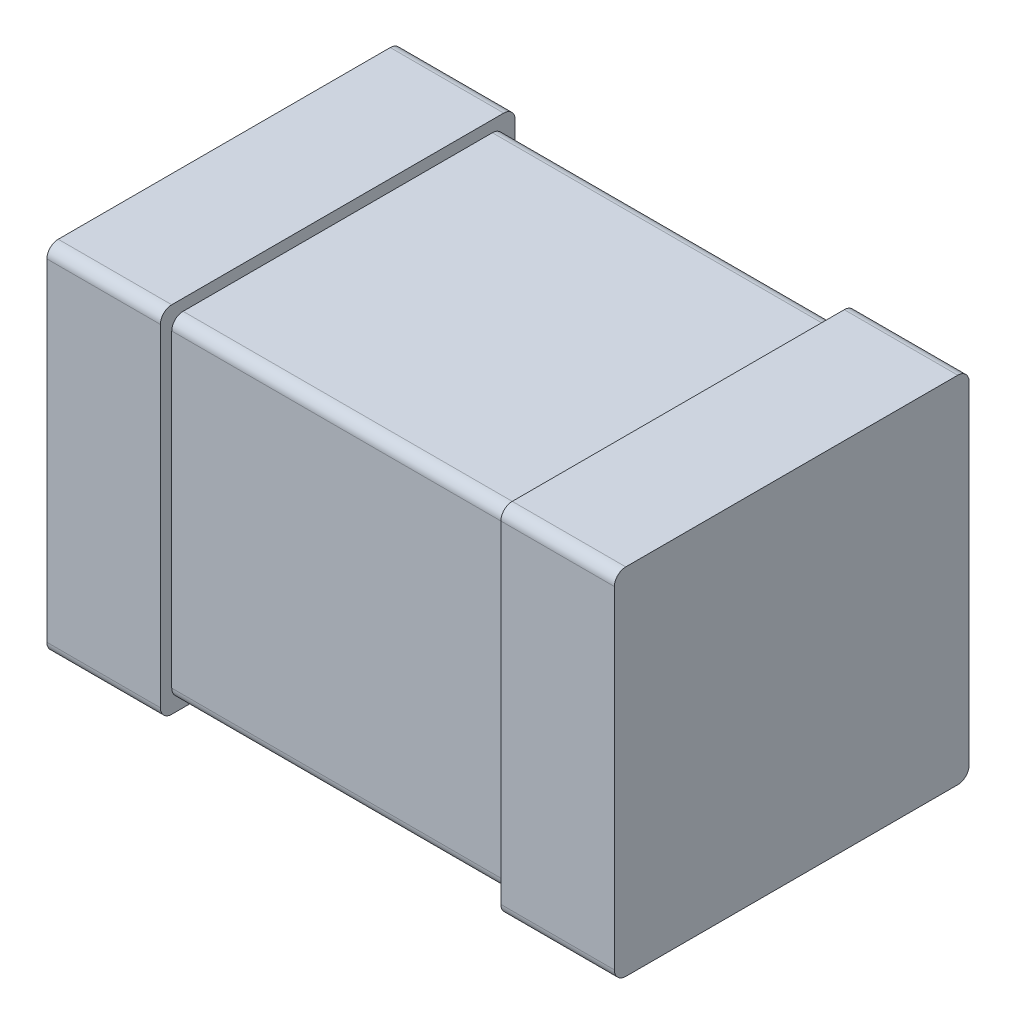
ISO-10303-21;
HEADER;
FILE_DESCRIPTION(('STEP AP214'),'2;1');
FILE_NAME('part.step','',(''),(''),'','','');
FILE_SCHEMA(('AUTOMOTIVE_DESIGN { 1 0 10303 214 1 1 1 1 }'));
ENDSEC;
DATA;
#1=APPLICATION_CONTEXT('core data for automotive mechanical design processes');
#2=APPLICATION_PROTOCOL_DEFINITION('international standard','automotive_design',2000,#1);
#3=PRODUCT_CONTEXT('',#1,'mechanical');
#4=PRODUCT('Part','Part','',(#3));
#5=PRODUCT_RELATED_PRODUCT_CATEGORY('part','',(#4));
#6=PRODUCT_DEFINITION_FORMATION('','',#4);
#7=PRODUCT_DEFINITION_CONTEXT('part definition',#1,'design');
#8=PRODUCT_DEFINITION('design','',#6,#7);
#9=PRODUCT_DEFINITION_SHAPE('','',#8);
#10=(LENGTH_UNIT() NAMED_UNIT(*) SI_UNIT(.MILLI.,.METRE.));
#11=(NAMED_UNIT(*) PLANE_ANGLE_UNIT() SI_UNIT($,.RADIAN.));
#12=(NAMED_UNIT(*) SI_UNIT($,.STERADIAN.) SOLID_ANGLE_UNIT());
#13=UNCERTAINTY_MEASURE_WITH_UNIT(LENGTH_MEASURE(1.E-05),#10,'distance_accuracy_value','');
#14=(GEOMETRIC_REPRESENTATION_CONTEXT(3) GLOBAL_UNCERTAINTY_ASSIGNED_CONTEXT((#13)) GLOBAL_UNIT_ASSIGNED_CONTEXT((#10,
#11,#12)) REPRESENTATION_CONTEXT('',''));
#15=CARTESIAN_POINT('',(0.,0.,0.));
#16=DIRECTION('',(0.,0.,1.));
#17=DIRECTION('',(1.,0.,0.));
#18=AXIS2_PLACEMENT_3D('',#15,#16,#17);
#19=CARTESIAN_POINT('',(1.,-0.625,0.));
#20=DIRECTION('',(1.,0.,0.));
#21=DIRECTION('',(0.,1.,0.));
#22=AXIS2_PLACEMENT_3D('',#19,#20,#21);
#23=PLANE('',#22);
#24=DIRECTION('',(0.,0.,1.));
#25=VECTOR('',#24,1.);
#26=CARTESIAN_POINT('',(1.,-0.625,0.));
#27=LINE('',#26,#25);
#28=CARTESIAN_POINT('',(1.,-0.625,0.04));
#29=VERTEX_POINT('',#28);
#30=CARTESIAN_POINT('',(1.,-0.625,1.21));
#31=VERTEX_POINT('',#30);
#32=EDGE_CURVE('E392',#29,#31,#27,.T.);
#33=ORIENTED_EDGE('',*,*,#32,.F.);
#34=CARTESIAN_POINT('',(1.,-0.585,0.04));
#35=DIRECTION('',(1.,0.,0.));
#36=DIRECTION('',(0.,0.,1.));
#37=AXIS2_PLACEMENT_3D('',#34,#35,#36);
#38=CIRCLE('',#37,0.04);
#39=CARTESIAN_POINT('',(1.,-0.585,0.));
#40=VERTEX_POINT('',#39);
#41=EDGE_CURVE('E343',#29,#40,#38,.T.);
#42=ORIENTED_EDGE('',*,*,#41,.T.);
#43=DIRECTION('',(0.,1.,0.));
#44=VECTOR('',#43,1.);
#45=CARTESIAN_POINT('',(1.,-0.625,0.));
#46=LINE('',#45,#44);
#47=CARTESIAN_POINT('',(1.,0.585,0.));
#48=VERTEX_POINT('',#47);
#49=EDGE_CURVE('E408',#40,#48,#46,.T.);
#50=ORIENTED_EDGE('',*,*,#49,.T.);
#51=CARTESIAN_POINT('',(1.,0.585,0.04));
#52=DIRECTION('',(-1.,0.,0.));
#53=DIRECTION('',(0.,0.,1.));
#54=AXIS2_PLACEMENT_3D('',#51,#52,#53);
#55=CIRCLE('',#54,0.04);
#56=CARTESIAN_POINT('',(1.,0.625,0.04));
#57=VERTEX_POINT('',#56);
#58=EDGE_CURVE('E361',#57,#48,#55,.T.);
#59=ORIENTED_EDGE('',*,*,#58,.F.);
#60=DIRECTION('',(0.,0.,1.));
#61=VECTOR('',#60,1.);
#62=CARTESIAN_POINT('',(1.,0.625,0.));
#63=LINE('',#62,#61);
#64=CARTESIAN_POINT('',(1.,0.625,1.21));
#65=VERTEX_POINT('',#64);
#66=EDGE_CURVE('E11',#57,#65,#63,.T.);
#67=ORIENTED_EDGE('',*,*,#66,.T.);
#68=CARTESIAN_POINT('',(1.,0.585,1.21));
#69=DIRECTION('',(1.,0.,0.));
#70=DIRECTION('',(0.,0.,1.));
#71=AXIS2_PLACEMENT_3D('',#68,#69,#70);
#72=CIRCLE('',#71,0.04);
#73=CARTESIAN_POINT('',(1.,0.585,1.25));
#74=VERTEX_POINT('',#73);
#75=EDGE_CURVE('E364',#65,#74,#72,.T.);
#76=ORIENTED_EDGE('',*,*,#75,.T.);
#77=DIRECTION('',(0.,1.,0.));
#78=VECTOR('',#77,1.);
#79=CARTESIAN_POINT('',(1.,-0.625,1.25));
#80=LINE('',#79,#78);
#81=CARTESIAN_POINT('',(1.,-0.585,1.25));
#82=VERTEX_POINT('',#81);
#83=EDGE_CURVE('E403',#82,#74,#80,.T.);
#84=ORIENTED_EDGE('',*,*,#83,.F.);
#85=CARTESIAN_POINT('',(1.,-0.585,1.21));
#86=DIRECTION('',(-1.,0.,0.));
#87=DIRECTION('',(0.,0.,1.));
#88=AXIS2_PLACEMENT_3D('',#85,#86,#87);
#89=CIRCLE('',#88,0.04);
#90=EDGE_CURVE('E338',#31,#82,#89,.T.);
#91=ORIENTED_EDGE('',*,*,#90,.F.);
#92=EDGE_LOOP('',(#33,#42,#50,#59,#67,#76,#84,#91));
#93=FACE_BOUND('',#92,.T.);
#94=ADVANCED_FACE('F17',(#93),#23,.T.);
#95=CARTESIAN_POINT('',(0.6,0.625,0.));
#96=DIRECTION('',(0.,1.,0.));
#97=DIRECTION('',(1.,0.,0.));
#98=AXIS2_PLACEMENT_3D('',#95,#96,#97);
#99=PLANE('',#98);
#100=ORIENTED_EDGE('',*,*,#66,.F.);
#101=DIRECTION('',(1.,0.,0.));
#102=VECTOR('',#101,1.);
#103=CARTESIAN_POINT('',(0.6,0.625,0.04));
#104=LINE('',#103,#102);
#105=CARTESIAN_POINT('',(0.6,0.625,0.04));
#106=VERTEX_POINT('',#105);
#107=EDGE_CURVE('E365',#106,#57,#104,.T.);
#108=ORIENTED_EDGE('',*,*,#107,.F.);
#109=DIRECTION('',(0.,0.,1.));
#110=VECTOR('',#109,1.);
#111=CARTESIAN_POINT('',(0.6,0.625,0.));
#112=LINE('',#111,#110);
#113=CARTESIAN_POINT('',(0.6,0.625,1.21));
#114=VERTEX_POINT('',#113);
#115=EDGE_CURVE('E374',#106,#114,#112,.T.);
#116=ORIENTED_EDGE('',*,*,#115,.T.);
#117=DIRECTION('',(1.,0.,0.));
#118=VECTOR('',#117,1.);
#119=CARTESIAN_POINT('',(0.6,0.625,1.21));
#120=LINE('',#119,#118);
#121=EDGE_CURVE('E25',#114,#65,#120,.T.);
#122=ORIENTED_EDGE('',*,*,#121,.T.);
#123=EDGE_LOOP('',(#100,#108,#116,#122));
#124=FACE_BOUND('',#123,.T.);
#125=ADVANCED_FACE('F419',(#124),#99,.T.);
#126=CARTESIAN_POINT('',(0.6,0.585,1.21));
#127=DIRECTION('',(1.,0.,0.));
#128=DIRECTION('',(0.,1.,0.));
#129=AXIS2_PLACEMENT_3D('',#126,#127,#128);
#130=CYLINDRICAL_SURFACE('',#129,0.04);
#131=CARTESIAN_POINT('',(0.6,0.585,1.21));
#132=DIRECTION('',(1.,0.,0.));
#133=DIRECTION('',(0.,0.,1.));
#134=AXIS2_PLACEMENT_3D('',#131,#132,#133);
#135=CIRCLE('',#134,0.04);
#136=CARTESIAN_POINT('',(0.6,0.585,1.25));
#137=VERTEX_POINT('',#136);
#138=EDGE_CURVE('E370',#114,#137,#135,.T.);
#139=ORIENTED_EDGE('',*,*,#138,.T.);
#140=DIRECTION('',(1.,0.,0.));
#141=VECTOR('',#140,1.);
#142=CARTESIAN_POINT('',(0.6,0.585,1.25));
#143=LINE('',#142,#141);
#144=EDGE_CURVE('E407',#137,#74,#143,.T.);
#145=ORIENTED_EDGE('',*,*,#144,.T.);
#146=ORIENTED_EDGE('',*,*,#75,.F.);
#147=ORIENTED_EDGE('',*,*,#121,.F.);
#148=EDGE_LOOP('',(#139,#145,#146,#147));
#149=FACE_BOUND('',#148,.T.);
#150=ADVANCED_FACE('F423',(#149),#130,.T.);
#151=CARTESIAN_POINT('',(0.6,0.585,0.04));
#152=DIRECTION('',(1.,0.,0.));
#153=DIRECTION('',(0.,1.,0.));
#154=AXIS2_PLACEMENT_3D('',#151,#152,#153);
#155=CYLINDRICAL_SURFACE('',#154,0.04);
#156=ORIENTED_EDGE('',*,*,#107,.T.);
#157=ORIENTED_EDGE('',*,*,#58,.T.);
#158=DIRECTION('',(1.,0.,0.));
#159=VECTOR('',#158,1.);
#160=CARTESIAN_POINT('',(0.6,0.585,0.));
#161=LINE('',#160,#159);
#162=CARTESIAN_POINT('',(0.6,0.585,0.));
#163=VERTEX_POINT('',#162);
#164=EDGE_CURVE('E357',#163,#48,#161,.T.);
#165=ORIENTED_EDGE('',*,*,#164,.F.);
#166=CARTESIAN_POINT('',(0.6,0.585,0.04));
#167=DIRECTION('',(-1.,0.,0.));
#168=DIRECTION('',(0.,0.,1.));
#169=AXIS2_PLACEMENT_3D('',#166,#167,#168);
#170=CIRCLE('',#169,0.04);
#171=EDGE_CURVE('E378',#106,#163,#170,.T.);
#172=ORIENTED_EDGE('',*,*,#171,.F.);
#173=EDGE_LOOP('',(#156,#157,#165,#172));
#174=FACE_BOUND('',#173,.T.);
#175=ADVANCED_FACE('F542',(#174),#155,.T.);
#176=CARTESIAN_POINT('',(0.6,-0.625,1.25));
#177=DIRECTION('',(0.,0.,1.));
#178=DIRECTION('',(1.,0.,0.));
#179=AXIS2_PLACEMENT_3D('',#176,#177,#178);
#180=PLANE('',#179);
#181=DIRECTION('',(0.,1.,0.));
#182=VECTOR('',#181,1.);
#183=CARTESIAN_POINT('',(0.6,-0.625,1.25));
#184=LINE('',#183,#182);
#185=CARTESIAN_POINT('',(0.6,-0.585,1.25));
#186=VERTEX_POINT('',#185);
#187=EDGE_CURVE('E369',#186,#137,#184,.T.);
#188=ORIENTED_EDGE('',*,*,#187,.F.);
#189=DIRECTION('',(1.,0.,0.));
#190=VECTOR('',#189,1.);
#191=CARTESIAN_POINT('',(0.6,-0.585,1.25));
#192=LINE('',#191,#190);
#193=EDGE_CURVE('E342',#186,#82,#192,.T.);
#194=ORIENTED_EDGE('',*,*,#193,.T.);
#195=ORIENTED_EDGE('',*,*,#83,.T.);
#196=ORIENTED_EDGE('',*,*,#144,.F.);
#197=EDGE_LOOP('',(#188,#194,#195,#196));
#198=FACE_BOUND('',#197,.T.);
#199=ADVANCED_FACE('F427',(#198),#180,.T.);
#200=CARTESIAN_POINT('',(0.6,-0.625,0.));
#201=DIRECTION('',(0.,0.,1.));
#202=DIRECTION('',(1.,0.,0.));
#203=AXIS2_PLACEMENT_3D('',#200,#201,#202);
#204=PLANE('',#203);
#205=ORIENTED_EDGE('',*,*,#164,.T.);
#206=ORIENTED_EDGE('',*,*,#49,.F.);
#207=DIRECTION('',(1.,0.,0.));
#208=VECTOR('',#207,1.);
#209=CARTESIAN_POINT('',(0.6,-0.585,0.));
#210=LINE('',#209,#208);
#211=CARTESIAN_POINT('',(0.6,-0.585,0.));
#212=VERTEX_POINT('',#211);
#213=EDGE_CURVE('E396',#212,#40,#210,.T.);
#214=ORIENTED_EDGE('',*,*,#213,.F.);
#215=DIRECTION('',(0.,1.,0.));
#216=VECTOR('',#215,1.);
#217=CARTESIAN_POINT('',(0.6,-0.625,0.));
#218=LINE('',#217,#216);
#219=EDGE_CURVE('E442',#212,#163,#218,.T.);
#220=ORIENTED_EDGE('',*,*,#219,.T.);
#221=EDGE_LOOP('',(#205,#206,#214,#220));
#222=FACE_BOUND('',#221,.T.);
#223=ADVANCED_FACE('F539',(#222),#204,.F.);
#224=CARTESIAN_POINT('',(0.6,-0.585,1.21));
#225=DIRECTION('',(1.,0.,0.));
#226=DIRECTION('',(0.,-1.,0.));
#227=AXIS2_PLACEMENT_3D('',#224,#225,#226);
#228=CYLINDRICAL_SURFACE('',#227,0.04);
#229=DIRECTION('',(1.,0.,0.));
#230=VECTOR('',#229,1.);
#231=CARTESIAN_POINT('',(0.6,-0.625,1.21));
#232=LINE('',#231,#230);
#233=CARTESIAN_POINT('',(0.6,-0.625,1.21));
#234=VERTEX_POINT('',#233);
#235=EDGE_CURVE('E383',#234,#31,#232,.T.);
#236=ORIENTED_EDGE('',*,*,#235,.T.);
#237=ORIENTED_EDGE('',*,*,#90,.T.);
#238=ORIENTED_EDGE('',*,*,#193,.F.);
#239=CARTESIAN_POINT('',(0.6,-0.585,1.21));
#240=DIRECTION('',(-1.,0.,0.));
#241=DIRECTION('',(0.,0.,1.));
#242=AXIS2_PLACEMENT_3D('',#239,#240,#241);
#243=CIRCLE('',#242,0.04);
#244=EDGE_CURVE('E360',#234,#186,#243,.T.);
#245=ORIENTED_EDGE('',*,*,#244,.F.);
#246=EDGE_LOOP('',(#236,#237,#238,#245));
#247=FACE_BOUND('',#246,.T.);
#248=ADVANCED_FACE('F431',(#247),#228,.T.);
#249=CARTESIAN_POINT('',(0.6,-0.585,0.04));
#250=DIRECTION('',(1.,0.,0.));
#251=DIRECTION('',(0.,-1.,0.));
#252=AXIS2_PLACEMENT_3D('',#249,#250,#251);
#253=CYLINDRICAL_SURFACE('',#252,0.04);
#254=CARTESIAN_POINT('',(0.6,-0.585,0.04));
#255=DIRECTION('',(1.,0.,0.));
#256=DIRECTION('',(0.,0.,1.));
#257=AXIS2_PLACEMENT_3D('',#254,#255,#256);
#258=CIRCLE('',#257,0.04);
#259=CARTESIAN_POINT('',(0.6,-0.625,0.04));
#260=VERTEX_POINT('',#259);
#261=EDGE_CURVE('E384',#260,#212,#258,.T.);
#262=ORIENTED_EDGE('',*,*,#261,.T.);
#263=ORIENTED_EDGE('',*,*,#213,.T.);
#264=ORIENTED_EDGE('',*,*,#41,.F.);
#265=DIRECTION('',(1.,0.,0.));
#266=VECTOR('',#265,1.);
#267=CARTESIAN_POINT('',(0.6,-0.625,0.04));
#268=LINE('',#267,#266);
#269=EDGE_CURVE('E388',#260,#29,#268,.T.);
#270=ORIENTED_EDGE('',*,*,#269,.F.);
#271=EDGE_LOOP('',(#262,#263,#264,#270));
#272=FACE_BOUND('',#271,.T.);
#273=ADVANCED_FACE('F543',(#272),#253,.T.);
#274=CARTESIAN_POINT('',(0.6,-0.625,0.));
#275=DIRECTION('',(0.,1.,0.));
#276=DIRECTION('',(1.,0.,0.));
#277=AXIS2_PLACEMENT_3D('',#274,#275,#276);
#278=PLANE('',#277);
#279=ORIENTED_EDGE('',*,*,#235,.F.);
#280=DIRECTION('',(0.,0.,1.));
#281=VECTOR('',#280,1.);
#282=CARTESIAN_POINT('',(0.6,-0.625,0.));
#283=LINE('',#282,#281);
#284=EDGE_CURVE('E379',#260,#234,#283,.T.);
#285=ORIENTED_EDGE('',*,*,#284,.F.);
#286=ORIENTED_EDGE('',*,*,#269,.T.);
#287=ORIENTED_EDGE('',*,*,#32,.T.);
#288=EDGE_LOOP('',(#279,#285,#286,#287));
#289=FACE_BOUND('',#288,.T.);
#290=ADVANCED_FACE('F434',(#289),#278,.F.);
#291=CARTESIAN_POINT('',(0.6,-0.625,0.));
#292=DIRECTION('',(1.,0.,0.));
#293=DIRECTION('',(0.,1.,0.));
#294=AXIS2_PLACEMENT_3D('',#291,#292,#293);
#295=PLANE('',#294);
#296=DIRECTION('',(0.,1.,0.));
#297=VECTOR('',#296,1.);
#298=CARTESIAN_POINT('',(0.6,-0.585,0.04));
#299=LINE('',#298,#297);
#300=CARTESIAN_POINT('',(0.6,-0.545,0.04));
#301=VERTEX_POINT('',#300);
#302=CARTESIAN_POINT('',(0.6,0.545,0.04));
#303=VERTEX_POINT('',#302);
#304=EDGE_CURVE('E286',#301,#303,#299,.T.);
#305=ORIENTED_EDGE('',*,*,#304,.T.);
#306=CARTESIAN_POINT('',(0.6,0.545,0.08));
#307=DIRECTION('',(-1.,0.,0.));
#308=DIRECTION('',(0.,0.,1.));
#309=AXIS2_PLACEMENT_3D('',#306,#307,#308);
#310=CIRCLE('',#309,0.04);
#311=CARTESIAN_POINT('',(0.6,0.585,0.08));
#312=VERTEX_POINT('',#311);
#313=EDGE_CURVE('E314',#312,#303,#310,.T.);
#314=ORIENTED_EDGE('',*,*,#313,.F.);
#315=DIRECTION('',(0.,0.,1.));
#316=VECTOR('',#315,1.);
#317=CARTESIAN_POINT('',(0.6,0.585,0.04));
#318=LINE('',#317,#316);
#319=CARTESIAN_POINT('',(0.6,0.585,1.17));
#320=VERTEX_POINT('',#319);
#321=EDGE_CURVE('E317',#312,#320,#318,.T.);
#322=ORIENTED_EDGE('',*,*,#321,.T.);
#323=CARTESIAN_POINT('',(0.6,0.545,1.17));
#324=DIRECTION('',(1.,0.,0.));
#325=DIRECTION('',(0.,0.,1.));
#326=AXIS2_PLACEMENT_3D('',#323,#324,#325);
#327=CIRCLE('',#326,0.04);
#328=CARTESIAN_POINT('',(0.6,0.545,1.21));
#329=VERTEX_POINT('',#328);
#330=EDGE_CURVE('E329',#320,#329,#327,.T.);
#331=ORIENTED_EDGE('',*,*,#330,.T.);
#332=DIRECTION('',(0.,1.,0.));
#333=VECTOR('',#332,1.);
#334=CARTESIAN_POINT('',(0.6,-0.585,1.21));
#335=LINE('',#334,#333);
#336=CARTESIAN_POINT('',(0.6,-0.545,1.21));
#337=VERTEX_POINT('',#336);
#338=EDGE_CURVE('E337',#337,#329,#335,.T.);
#339=ORIENTED_EDGE('',*,*,#338,.F.);
#340=CARTESIAN_POINT('',(0.6,-0.545,1.17));
#341=DIRECTION('',(-1.,0.,0.));
#342=DIRECTION('',(0.,0.,1.));
#343=AXIS2_PLACEMENT_3D('',#340,#341,#342);
#344=CIRCLE('',#343,0.04);
#345=CARTESIAN_POINT('',(0.6,-0.585,1.17));
#346=VERTEX_POINT('',#345);
#347=EDGE_CURVE('E350',#346,#337,#344,.T.);
#348=ORIENTED_EDGE('',*,*,#347,.F.);
#349=DIRECTION('',(0.,0.,1.));
#350=VECTOR('',#349,1.);
#351=CARTESIAN_POINT('',(0.6,-0.585,0.04));
#352=LINE('',#351,#350);
#353=CARTESIAN_POINT('',(0.6,-0.585,0.08));
#354=VERTEX_POINT('',#353);
#355=EDGE_CURVE('E353',#354,#346,#352,.T.);
#356=ORIENTED_EDGE('',*,*,#355,.F.);
#357=CARTESIAN_POINT('',(0.6,-0.545,0.08));
#358=DIRECTION('',(1.,0.,0.));
#359=DIRECTION('',(0.,0.,1.));
#360=AXIS2_PLACEMENT_3D('',#357,#358,#359);
#361=CIRCLE('',#360,0.04);
#362=EDGE_CURVE('E296',#354,#301,#361,.T.);
#363=ORIENTED_EDGE('',*,*,#362,.T.);
#364=EDGE_LOOP('',(#305,#314,#322,#331,#339,#348,#356,#363));
#365=FACE_BOUND('',#364,.T.);
#366=ORIENTED_EDGE('',*,*,#244,.T.);
#367=ORIENTED_EDGE('',*,*,#187,.T.);
#368=ORIENTED_EDGE('',*,*,#138,.F.);
#369=ORIENTED_EDGE('',*,*,#115,.F.);
#370=ORIENTED_EDGE('',*,*,#171,.T.);
#371=ORIENTED_EDGE('',*,*,#219,.F.);
#372=ORIENTED_EDGE('',*,*,#261,.F.);
#373=ORIENTED_EDGE('',*,*,#284,.T.);
#374=EDGE_LOOP('',(#366,#367,#368,#369,#370,#371,#372,#373));
#375=FACE_BOUND('',#374,.T.);
#376=ADVANCED_FACE('F437',(#365,#375),#295,.F.);
#377=CARTESIAN_POINT('',(-0.6,-0.585,0.04));
#378=DIRECTION('',(0.,1.,0.));
#379=DIRECTION('',(1.,0.,0.));
#380=AXIS2_PLACEMENT_3D('',#377,#378,#379);
#381=PLANE('',#380);
#382=DIRECTION('',(1.,0.,0.));
#383=VECTOR('',#382,1.);
#384=CARTESIAN_POINT('',(-0.6,-0.585,1.17));
#385=LINE('',#384,#383);
#386=CARTESIAN_POINT('',(-0.6,-0.585,1.17));
#387=VERTEX_POINT('',#386);
#388=EDGE_CURVE('E346',#387,#346,#385,.T.);
#389=ORIENTED_EDGE('',*,*,#388,.F.);
#390=DIRECTION('',(0.,0.,1.));
#391=VECTOR('',#390,1.);
#392=CARTESIAN_POINT('',(-0.6,-0.585,0.04));
#393=LINE('',#392,#391);
#394=CARTESIAN_POINT('',(-0.6,-0.585,0.08));
#395=VERTEX_POINT('',#394);
#396=EDGE_CURVE('E268',#395,#387,#393,.T.);
#397=ORIENTED_EDGE('',*,*,#396,.F.);
#398=DIRECTION('',(1.,0.,0.));
#399=VECTOR('',#398,1.);
#400=CARTESIAN_POINT('',(-0.6,-0.585,0.08));
#401=LINE('',#400,#399);
#402=EDGE_CURVE('E307',#395,#354,#401,.T.);
#403=ORIENTED_EDGE('',*,*,#402,.T.);
#404=ORIENTED_EDGE('',*,*,#355,.T.);
#405=EDGE_LOOP('',(#389,#397,#403,#404));
#406=FACE_BOUND('',#405,.T.);
#407=ADVANCED_FACE('F573',(#406),#381,.F.);
#408=CARTESIAN_POINT('',(-0.6,-0.545,1.17));
#409=DIRECTION('',(1.,0.,0.));
#410=DIRECTION('',(0.,-1.,0.));
#411=AXIS2_PLACEMENT_3D('',#408,#409,#410);
#412=CYLINDRICAL_SURFACE('',#411,0.04);
#413=ORIENTED_EDGE('',*,*,#388,.T.);
#414=ORIENTED_EDGE('',*,*,#347,.T.);
#415=DIRECTION('',(1.,0.,0.));
#416=VECTOR('',#415,1.);
#417=CARTESIAN_POINT('',(-0.6,-0.545,1.21));
#418=LINE('',#417,#416);
#419=CARTESIAN_POINT('',(-0.6,-0.545,1.21));
#420=VERTEX_POINT('',#419);
#421=EDGE_CURVE('E333',#420,#337,#418,.T.);
#422=ORIENTED_EDGE('',*,*,#421,.F.);
#423=CARTESIAN_POINT('',(-0.6,-0.545,1.17));
#424=DIRECTION('',(-1.,0.,0.));
#425=DIRECTION('',(0.,0.,1.));
#426=AXIS2_PLACEMENT_3D('',#423,#424,#425);
#427=CIRCLE('',#426,0.04);
#428=EDGE_CURVE('E269',#387,#420,#427,.T.);
#429=ORIENTED_EDGE('',*,*,#428,.F.);
#430=EDGE_LOOP('',(#413,#414,#422,#429));
#431=FACE_BOUND('',#430,.T.);
#432=ADVANCED_FACE('F576',(#431),#412,.T.);
#433=CARTESIAN_POINT('',(-0.6,-0.585,1.21));
#434=DIRECTION('',(0.,0.,1.));
#435=DIRECTION('',(1.,0.,0.));
#436=AXIS2_PLACEMENT_3D('',#433,#434,#435);
#437=PLANE('',#436);
#438=DIRECTION('',(0.,1.,0.));
#439=VECTOR('',#438,1.);
#440=CARTESIAN_POINT('',(-0.6,-0.585,1.21));
#441=LINE('',#440,#439);
#442=CARTESIAN_POINT('',(-0.6,0.545,1.21));
#443=VERTEX_POINT('',#442);
#444=EDGE_CURVE('E273',#420,#443,#441,.T.);
#445=ORIENTED_EDGE('',*,*,#444,.F.);
#446=ORIENTED_EDGE('',*,*,#421,.T.);
#447=ORIENTED_EDGE('',*,*,#338,.T.);
#448=DIRECTION('',(1.,0.,0.));
#449=VECTOR('',#448,1.);
#450=CARTESIAN_POINT('',(-0.6,0.545,1.21));
#451=LINE('',#450,#449);
#452=EDGE_CURVE('E325',#443,#329,#451,.T.);
#453=ORIENTED_EDGE('',*,*,#452,.F.);
#454=EDGE_LOOP('',(#445,#446,#447,#453));
#455=FACE_BOUND('',#454,.T.);
#456=ADVANCED_FACE('F594',(#455),#437,.T.);
#457=CARTESIAN_POINT('',(-0.6,0.545,1.17));
#458=DIRECTION('',(1.,0.,0.));
#459=DIRECTION('',(0.,1.,0.));
#460=AXIS2_PLACEMENT_3D('',#457,#458,#459);
#461=CYLINDRICAL_SURFACE('',#460,0.04);
#462=CARTESIAN_POINT('',(-0.6,0.545,1.17));
#463=DIRECTION('',(1.,0.,0.));
#464=DIRECTION('',(0.,0.,1.));
#465=AXIS2_PLACEMENT_3D('',#462,#463,#464);
#466=CIRCLE('',#465,0.04);
#467=CARTESIAN_POINT('',(-0.6,0.585,1.17));
#468=VERTEX_POINT('',#467);
#469=EDGE_CURVE('E277',#468,#443,#466,.T.);
#470=ORIENTED_EDGE('',*,*,#469,.T.);
#471=ORIENTED_EDGE('',*,*,#452,.T.);
#472=ORIENTED_EDGE('',*,*,#330,.F.);
#473=DIRECTION('',(1.,0.,0.));
#474=VECTOR('',#473,1.);
#475=CARTESIAN_POINT('',(-0.6,0.585,1.17));
#476=LINE('',#475,#474);
#477=EDGE_CURVE('E321',#468,#320,#476,.T.);
#478=ORIENTED_EDGE('',*,*,#477,.F.);
#479=EDGE_LOOP('',(#470,#471,#472,#478));
#480=FACE_BOUND('',#479,.T.);
#481=ADVANCED_FACE('F582',(#480),#461,.T.);
#482=CARTESIAN_POINT('',(-0.6,0.585,0.04));
#483=DIRECTION('',(0.,1.,0.));
#484=DIRECTION('',(1.,0.,0.));
#485=AXIS2_PLACEMENT_3D('',#482,#483,#484);
#486=PLANE('',#485);
#487=ORIENTED_EDGE('',*,*,#321,.F.);
#488=DIRECTION('',(1.,0.,0.));
#489=VECTOR('',#488,1.);
#490=CARTESIAN_POINT('',(-0.6,0.585,0.08));
#491=LINE('',#490,#489);
#492=CARTESIAN_POINT('',(-0.6,0.585,0.08));
#493=VERTEX_POINT('',#492);
#494=EDGE_CURVE('E290',#493,#312,#491,.T.);
#495=ORIENTED_EDGE('',*,*,#494,.F.);
#496=DIRECTION('',(0.,0.,1.));
#497=VECTOR('',#496,1.);
#498=CARTESIAN_POINT('',(-0.6,0.585,0.04));
#499=LINE('',#498,#497);
#500=EDGE_CURVE('E281',#493,#468,#499,.T.);
#501=ORIENTED_EDGE('',*,*,#500,.T.);
#502=ORIENTED_EDGE('',*,*,#477,.T.);
#503=EDGE_LOOP('',(#487,#495,#501,#502));
#504=FACE_BOUND('',#503,.T.);
#505=ADVANCED_FACE('F578',(#504),#486,.T.);
#506=CARTESIAN_POINT('',(-0.6,0.545,0.08));
#507=DIRECTION('',(1.,0.,0.));
#508=DIRECTION('',(0.,1.,0.));
#509=AXIS2_PLACEMENT_3D('',#506,#507,#508);
#510=CYLINDRICAL_SURFACE('',#509,0.04);
#511=ORIENTED_EDGE('',*,*,#494,.T.);
#512=ORIENTED_EDGE('',*,*,#313,.T.);
#513=DIRECTION('',(1.,0.,0.));
#514=VECTOR('',#513,1.);
#515=CARTESIAN_POINT('',(-0.6,0.545,0.04));
#516=LINE('',#515,#514);
#517=CARTESIAN_POINT('',(-0.6,0.545,0.04));
#518=VERTEX_POINT('',#517);
#519=EDGE_CURVE('E291',#518,#303,#516,.T.);
#520=ORIENTED_EDGE('',*,*,#519,.F.);
#521=CARTESIAN_POINT('',(-0.6,0.545,0.08));
#522=DIRECTION('',(-1.,0.,0.));
#523=DIRECTION('',(0.,0.,1.));
#524=AXIS2_PLACEMENT_3D('',#521,#522,#523);
#525=CIRCLE('',#524,0.04);
#526=EDGE_CURVE('E285',#493,#518,#525,.T.);
#527=ORIENTED_EDGE('',*,*,#526,.F.);
#528=EDGE_LOOP('',(#511,#512,#520,#527));
#529=FACE_BOUND('',#528,.T.);
#530=ADVANCED_FACE('F581',(#529),#510,.T.);
#531=CARTESIAN_POINT('',(-0.6,-0.585,0.04));
#532=DIRECTION('',(0.,0.,1.));
#533=DIRECTION('',(1.,0.,0.));
#534=AXIS2_PLACEMENT_3D('',#531,#532,#533);
#535=PLANE('',#534);
#536=ORIENTED_EDGE('',*,*,#519,.T.);
#537=ORIENTED_EDGE('',*,*,#304,.F.);
#538=DIRECTION('',(1.,0.,0.));
#539=VECTOR('',#538,1.);
#540=CARTESIAN_POINT('',(-0.6,-0.545,0.04));
#541=LINE('',#540,#539);
#542=CARTESIAN_POINT('',(-0.6,-0.545,0.04));
#543=VERTEX_POINT('',#542);
#544=EDGE_CURVE('E292',#543,#301,#541,.T.);
#545=ORIENTED_EDGE('',*,*,#544,.F.);
#546=DIRECTION('',(0.,1.,0.));
#547=VECTOR('',#546,1.);
#548=CARTESIAN_POINT('',(-0.6,-0.585,0.04));
#549=LINE('',#548,#547);
#550=EDGE_CURVE('E297',#543,#518,#549,.T.);
#551=ORIENTED_EDGE('',*,*,#550,.T.);
#552=EDGE_LOOP('',(#536,#537,#545,#551));
#553=FACE_BOUND('',#552,.T.);
#554=ADVANCED_FACE('F598',(#553),#535,.F.);
#555=CARTESIAN_POINT('',(-0.6,-0.545,0.08));
#556=DIRECTION('',(1.,0.,0.));
#557=DIRECTION('',(0.,-1.,0.));
#558=AXIS2_PLACEMENT_3D('',#555,#556,#557);
#559=CYLINDRICAL_SURFACE('',#558,0.04);
#560=CARTESIAN_POINT('',(-0.6,-0.545,0.08));
#561=DIRECTION('',(1.,0.,0.));
#562=DIRECTION('',(0.,0.,1.));
#563=AXIS2_PLACEMENT_3D('',#560,#561,#562);
#564=CIRCLE('',#563,0.04);
#565=EDGE_CURVE('E237',#395,#543,#564,.T.);
#566=ORIENTED_EDGE('',*,*,#565,.T.);
#567=ORIENTED_EDGE('',*,*,#544,.T.);
#568=ORIENTED_EDGE('',*,*,#362,.F.);
#569=ORIENTED_EDGE('',*,*,#402,.F.);
#570=EDGE_LOOP('',(#566,#567,#568,#569));
#571=FACE_BOUND('',#570,.T.);
#572=ADVANCED_FACE('F795',(#571),#559,.T.);
#573=CARTESIAN_POINT('',(-0.6,-0.625,0.));
#574=DIRECTION('',(1.,0.,0.));
#575=DIRECTION('',(0.,1.,0.));
#576=AXIS2_PLACEMENT_3D('',#573,#574,#575);
#577=PLANE('',#576);
#578=ORIENTED_EDGE('',*,*,#565,.F.);
#579=ORIENTED_EDGE('',*,*,#396,.T.);
#580=ORIENTED_EDGE('',*,*,#428,.T.);
#581=ORIENTED_EDGE('',*,*,#444,.T.);
#582=ORIENTED_EDGE('',*,*,#469,.F.);
#583=ORIENTED_EDGE('',*,*,#500,.F.);
#584=ORIENTED_EDGE('',*,*,#526,.T.);
#585=ORIENTED_EDGE('',*,*,#550,.F.);
#586=EDGE_LOOP('',(#578,#579,#580,#581,#582,#583,#584,#585));
#587=FACE_BOUND('',#586,.T.);
#588=DIRECTION('',(0.,0.,1.));
#589=VECTOR('',#588,1.);
#590=CARTESIAN_POINT('',(-0.6,-0.625,0.));
#591=LINE('',#590,#589);
#592=CARTESIAN_POINT('',(-0.6,-0.625,0.04));
#593=VERTEX_POINT('',#592);
#594=CARTESIAN_POINT('',(-0.6,-0.625,1.21));
#595=VERTEX_POINT('',#594);
#596=EDGE_CURVE('E474',#593,#595,#591,.T.);
#597=ORIENTED_EDGE('',*,*,#596,.F.);
#598=CARTESIAN_POINT('',(-0.6,-0.585,0.04));
#599=DIRECTION('',(1.,0.,0.));
#600=DIRECTION('',(0.,0.,1.));
#601=AXIS2_PLACEMENT_3D('',#598,#599,#600);
#602=CIRCLE('',#601,0.04);
#603=CARTESIAN_POINT('',(-0.6,-0.585,0.));
#604=VERTEX_POINT('',#603);
#605=EDGE_CURVE('E491',#593,#604,#602,.T.);
#606=ORIENTED_EDGE('',*,*,#605,.T.);
#607=DIRECTION('',(0.,1.,0.));
#608=VECTOR('',#607,1.);
#609=CARTESIAN_POINT('',(-0.6,-0.625,0.));
#610=LINE('',#609,#608);
#611=CARTESIAN_POINT('',(-0.6,0.585,0.));
#612=VERTEX_POINT('',#611);
#613=EDGE_CURVE('E244',#604,#612,#610,.T.);
#614=ORIENTED_EDGE('',*,*,#613,.T.);
#615=CARTESIAN_POINT('',(-0.6,0.585,0.04));
#616=DIRECTION('',(-1.,0.,0.));
#617=DIRECTION('',(0.,0.,1.));
#618=AXIS2_PLACEMENT_3D('',#615,#616,#617);
#619=CIRCLE('',#618,0.04);
#620=CARTESIAN_POINT('',(-0.6,0.625,0.04));
#621=VERTEX_POINT('',#620);
#622=EDGE_CURVE('E240',#621,#612,#619,.T.);
#623=ORIENTED_EDGE('',*,*,#622,.F.);
#624=DIRECTION('',(0.,0.,1.));
#625=VECTOR('',#624,1.);
#626=CARTESIAN_POINT('',(-0.6,0.625,0.));
#627=LINE('',#626,#625);
#628=CARTESIAN_POINT('',(-0.6,0.625,1.21));
#629=VERTEX_POINT('',#628);
#630=EDGE_CURVE('E226',#621,#629,#627,.T.);
#631=ORIENTED_EDGE('',*,*,#630,.T.);
#632=CARTESIAN_POINT('',(-0.6,0.585,1.21));
#633=DIRECTION('',(1.,0.,0.));
#634=DIRECTION('',(0.,0.,1.));
#635=AXIS2_PLACEMENT_3D('',#632,#633,#634);
#636=CIRCLE('',#635,0.04);
#637=CARTESIAN_POINT('',(-0.6,0.585,1.25));
#638=VERTEX_POINT('',#637);
#639=EDGE_CURVE('E248',#629,#638,#636,.T.);
#640=ORIENTED_EDGE('',*,*,#639,.T.);
#641=DIRECTION('',(0.,1.,0.));
#642=VECTOR('',#641,1.);
#643=CARTESIAN_POINT('',(-0.6,-0.625,1.25));
#644=LINE('',#643,#642);
#645=CARTESIAN_POINT('',(-0.6,-0.585,1.25));
#646=VERTEX_POINT('',#645);
#647=EDGE_CURVE('E261',#646,#638,#644,.T.);
#648=ORIENTED_EDGE('',*,*,#647,.F.);
#649=CARTESIAN_POINT('',(-0.6,-0.585,1.21));
#650=DIRECTION('',(-1.,0.,0.));
#651=DIRECTION('',(0.,0.,1.));
#652=AXIS2_PLACEMENT_3D('',#649,#650,#651);
#653=CIRCLE('',#652,0.04);
#654=EDGE_CURVE('E487',#595,#646,#653,.T.);
#655=ORIENTED_EDGE('',*,*,#654,.F.);
#656=EDGE_LOOP('',(#597,#606,#614,#623,#631,#640,#648,#655));
#657=FACE_BOUND('',#656,.T.);
#658=ADVANCED_FACE('F242',(#587,#657),#577,.T.);
#659=CARTESIAN_POINT('',(-1.,0.625,0.));
#660=DIRECTION('',(0.,1.,0.));
#661=DIRECTION('',(1.,0.,0.));
#662=AXIS2_PLACEMENT_3D('',#659,#660,#661);
#663=PLANE('',#662);
#664=ORIENTED_EDGE('',*,*,#630,.F.);
#665=DIRECTION('',(1.,0.,0.));
#666=VECTOR('',#665,1.);
#667=CARTESIAN_POINT('',(-1.,0.625,0.04));
#668=LINE('',#667,#666);
#669=CARTESIAN_POINT('',(-1.,0.625,0.04));
#670=VERTEX_POINT('',#669);
#671=EDGE_CURVE('E231',#670,#621,#668,.T.);
#672=ORIENTED_EDGE('',*,*,#671,.F.);
#673=DIRECTION('',(0.,0.,1.));
#674=VECTOR('',#673,1.);
#675=CARTESIAN_POINT('',(-1.,0.625,0.));
#676=LINE('',#675,#674);
#677=CARTESIAN_POINT('',(-1.,0.625,1.21));
#678=VERTEX_POINT('',#677);
#679=EDGE_CURVE('E511',#670,#678,#676,.T.);
#680=ORIENTED_EDGE('',*,*,#679,.T.);
#681=DIRECTION('',(1.,0.,0.));
#682=VECTOR('',#681,1.);
#683=CARTESIAN_POINT('',(-1.,0.625,1.21));
#684=LINE('',#683,#682);
#685=EDGE_CURVE('E233',#678,#629,#684,.T.);
#686=ORIENTED_EDGE('',*,*,#685,.T.);
#687=EDGE_LOOP('',(#664,#672,#680,#686));
#688=FACE_BOUND('',#687,.T.);
#689=ADVANCED_FACE('F228',(#688),#663,.T.);
#690=CARTESIAN_POINT('',(-1.,0.585,1.21));
#691=DIRECTION('',(1.,0.,0.));
#692=DIRECTION('',(0.,1.,0.));
#693=AXIS2_PLACEMENT_3D('',#690,#691,#692);
#694=CYLINDRICAL_SURFACE('',#693,0.04);
#695=CARTESIAN_POINT('',(-1.,0.585,1.21));
#696=DIRECTION('',(1.,0.,0.));
#697=DIRECTION('',(0.,0.,1.));
#698=AXIS2_PLACEMENT_3D('',#695,#696,#697);
#699=CIRCLE('',#698,0.04);
#700=CARTESIAN_POINT('',(-1.,0.585,1.25));
#701=VERTEX_POINT('',#700);
#702=EDGE_CURVE('E507',#678,#701,#699,.T.);
#703=ORIENTED_EDGE('',*,*,#702,.T.);
#704=DIRECTION('',(1.,0.,0.));
#705=VECTOR('',#704,1.);
#706=CARTESIAN_POINT('',(-1.,0.585,1.25));
#707=LINE('',#706,#705);
#708=EDGE_CURVE('E255',#701,#638,#707,.T.);
#709=ORIENTED_EDGE('',*,*,#708,.T.);
#710=ORIENTED_EDGE('',*,*,#639,.F.);
#711=ORIENTED_EDGE('',*,*,#685,.F.);
#712=EDGE_LOOP('',(#703,#709,#710,#711));
#713=FACE_BOUND('',#712,.T.);
#714=ADVANCED_FACE('F505',(#713),#694,.T.);
#715=CARTESIAN_POINT('',(-1.,0.585,0.04));
#716=DIRECTION('',(1.,0.,0.));
#717=DIRECTION('',(0.,1.,0.));
#718=AXIS2_PLACEMENT_3D('',#715,#716,#717);
#719=CYLINDRICAL_SURFACE('',#718,0.04);
#720=ORIENTED_EDGE('',*,*,#671,.T.);
#721=ORIENTED_EDGE('',*,*,#622,.T.);
#722=DIRECTION('',(1.,0.,0.));
#723=VECTOR('',#722,1.);
#724=CARTESIAN_POINT('',(-1.,0.585,0.));
#725=LINE('',#724,#723);
#726=CARTESIAN_POINT('',(-1.,0.585,0.));
#727=VERTEX_POINT('',#726);
#728=EDGE_CURVE('E453',#727,#612,#725,.T.);
#729=ORIENTED_EDGE('',*,*,#728,.F.);
#730=CARTESIAN_POINT('',(-1.,0.585,0.04));
#731=DIRECTION('',(-1.,0.,0.));
#732=DIRECTION('',(0.,0.,1.));
#733=AXIS2_PLACEMENT_3D('',#730,#731,#732);
#734=CIRCLE('',#733,0.04);
#735=EDGE_CURVE('E252',#670,#727,#734,.T.);
#736=ORIENTED_EDGE('',*,*,#735,.F.);
#737=EDGE_LOOP('',(#720,#721,#729,#736));
#738=FACE_BOUND('',#737,.T.);
#739=ADVANCED_FACE('F250',(#738),#719,.T.);
#740=CARTESIAN_POINT('',(-1.,-0.625,1.25));
#741=DIRECTION('',(0.,0.,1.));
#742=DIRECTION('',(1.,0.,0.));
#743=AXIS2_PLACEMENT_3D('',#740,#741,#742);
#744=PLANE('',#743);
#745=DIRECTION('',(0.,1.,0.));
#746=VECTOR('',#745,1.);
#747=CARTESIAN_POINT('',(-1.,-0.625,1.25));
#748=LINE('',#747,#746);
#749=CARTESIAN_POINT('',(-1.,-0.585,1.25));
#750=VERTEX_POINT('',#749);
#751=EDGE_CURVE('E512',#750,#701,#748,.T.);
#752=ORIENTED_EDGE('',*,*,#751,.F.);
#753=DIRECTION('',(1.,0.,0.));
#754=VECTOR('',#753,1.);
#755=CARTESIAN_POINT('',(-1.,-0.585,1.25));
#756=LINE('',#755,#754);
#757=EDGE_CURVE('E483',#750,#646,#756,.T.);
#758=ORIENTED_EDGE('',*,*,#757,.T.);
#759=ORIENTED_EDGE('',*,*,#647,.T.);
#760=ORIENTED_EDGE('',*,*,#708,.F.);
#761=EDGE_LOOP('',(#752,#758,#759,#760));
#762=FACE_BOUND('',#761,.T.);
#763=ADVANCED_FACE('F502',(#762),#744,.T.);
#764=CARTESIAN_POINT('',(-1.,-0.625,0.));
#765=DIRECTION('',(0.,0.,1.));
#766=DIRECTION('',(1.,0.,0.));
#767=AXIS2_PLACEMENT_3D('',#764,#765,#766);
#768=PLANE('',#767);
#769=ORIENTED_EDGE('',*,*,#728,.T.);
#770=ORIENTED_EDGE('',*,*,#613,.F.);
#771=DIRECTION('',(1.,0.,0.));
#772=VECTOR('',#771,1.);
#773=CARTESIAN_POINT('',(-1.,-0.585,0.));
#774=LINE('',#773,#772);
#775=CARTESIAN_POINT('',(-1.,-0.585,0.));
#776=VERTEX_POINT('',#775);
#777=EDGE_CURVE('E480',#776,#604,#774,.T.);
#778=ORIENTED_EDGE('',*,*,#777,.F.);
#779=DIRECTION('',(0.,1.,0.));
#780=VECTOR('',#779,1.);
#781=CARTESIAN_POINT('',(-1.,-0.625,0.));
#782=LINE('',#781,#780);
#783=EDGE_CURVE('E459',#776,#727,#782,.T.);
#784=ORIENTED_EDGE('',*,*,#783,.T.);
#785=EDGE_LOOP('',(#769,#770,#778,#784));
#786=FACE_BOUND('',#785,.T.);
#787=ADVANCED_FACE('F569',(#786),#768,.F.);
#788=CARTESIAN_POINT('',(-1.,-0.585,1.21));
#789=DIRECTION('',(1.,0.,0.));
#790=DIRECTION('',(0.,-1.,0.));
#791=AXIS2_PLACEMENT_3D('',#788,#789,#790);
#792=CYLINDRICAL_SURFACE('',#791,0.04);
#793=DIRECTION('',(1.,0.,0.));
#794=VECTOR('',#793,1.);
#795=CARTESIAN_POINT('',(-1.,-0.625,1.21));
#796=LINE('',#795,#794);
#797=CARTESIAN_POINT('',(-1.,-0.625,1.21));
#798=VERTEX_POINT('',#797);
#799=EDGE_CURVE('E460',#798,#595,#796,.T.);
#800=ORIENTED_EDGE('',*,*,#799,.T.);
#801=ORIENTED_EDGE('',*,*,#654,.T.);
#802=ORIENTED_EDGE('',*,*,#757,.F.);
#803=CARTESIAN_POINT('',(-1.,-0.585,1.21));
#804=DIRECTION('',(-1.,0.,0.));
#805=DIRECTION('',(0.,0.,1.));
#806=AXIS2_PLACEMENT_3D('',#803,#804,#805);
#807=CIRCLE('',#806,0.04);
#808=EDGE_CURVE('E517',#798,#750,#807,.T.);
#809=ORIENTED_EDGE('',*,*,#808,.F.);
#810=EDGE_LOOP('',(#800,#801,#802,#809));
#811=FACE_BOUND('',#810,.T.);
#812=ADVANCED_FACE('F567',(#811),#792,.T.);
#813=CARTESIAN_POINT('',(-1.,-0.585,0.04));
#814=DIRECTION('',(1.,0.,0.));
#815=DIRECTION('',(0.,-1.,0.));
#816=AXIS2_PLACEMENT_3D('',#813,#814,#815);
#817=CYLINDRICAL_SURFACE('',#816,0.04);
#818=CARTESIAN_POINT('',(-1.,-0.585,0.04));
#819=DIRECTION('',(1.,0.,0.));
#820=DIRECTION('',(0.,0.,1.));
#821=AXIS2_PLACEMENT_3D('',#818,#819,#820);
#822=CIRCLE('',#821,0.04);
#823=CARTESIAN_POINT('',(-1.,-0.625,0.04));
#824=VERTEX_POINT('',#823);
#825=EDGE_CURVE('E455',#824,#776,#822,.T.);
#826=ORIENTED_EDGE('',*,*,#825,.T.);
#827=ORIENTED_EDGE('',*,*,#777,.T.);
#828=ORIENTED_EDGE('',*,*,#605,.F.);
#829=DIRECTION('',(1.,0.,0.));
#830=VECTOR('',#829,1.);
#831=CARTESIAN_POINT('',(-1.,-0.625,0.04));
#832=LINE('',#831,#830);
#833=EDGE_CURVE('E464',#824,#593,#832,.T.);
#834=ORIENTED_EDGE('',*,*,#833,.F.);
#835=EDGE_LOOP('',(#826,#827,#828,#834));
#836=FACE_BOUND('',#835,.T.);
#837=ADVANCED_FACE('F787',(#836),#817,.T.);
#838=CARTESIAN_POINT('',(-1.,-0.625,0.));
#839=DIRECTION('',(0.,1.,0.));
#840=DIRECTION('',(1.,0.,0.));
#841=AXIS2_PLACEMENT_3D('',#838,#839,#840);
#842=PLANE('',#841);
#843=ORIENTED_EDGE('',*,*,#799,.F.);
#844=DIRECTION('',(0.,0.,1.));
#845=VECTOR('',#844,1.);
#846=CARTESIAN_POINT('',(-1.,-0.625,0.));
#847=LINE('',#846,#845);
#848=EDGE_CURVE('E458',#824,#798,#847,.T.);
#849=ORIENTED_EDGE('',*,*,#848,.F.);
#850=ORIENTED_EDGE('',*,*,#833,.T.);
#851=ORIENTED_EDGE('',*,*,#596,.T.);
#852=EDGE_LOOP('',(#843,#849,#850,#851));
#853=FACE_BOUND('',#852,.T.);
#854=ADVANCED_FACE('F810',(#853),#842,.F.);
#855=CARTESIAN_POINT('',(-1.,-0.625,0.));
#856=DIRECTION('',(1.,0.,0.));
#857=DIRECTION('',(0.,1.,0.));
#858=AXIS2_PLACEMENT_3D('',#855,#856,#857);
#859=PLANE('',#858);
#860=ORIENTED_EDGE('',*,*,#808,.T.);
#861=ORIENTED_EDGE('',*,*,#751,.T.);
#862=ORIENTED_EDGE('',*,*,#702,.F.);
#863=ORIENTED_EDGE('',*,*,#679,.F.);
#864=ORIENTED_EDGE('',*,*,#735,.T.);
#865=ORIENTED_EDGE('',*,*,#783,.F.);
#866=ORIENTED_EDGE('',*,*,#825,.F.);
#867=ORIENTED_EDGE('',*,*,#848,.T.);
#868=EDGE_LOOP('',(#860,#861,#862,#863,#864,#865,#866,#867));
#869=FACE_BOUND('',#868,.T.);
#870=ADVANCED_FACE('F515',(#869),#859,.F.);
#871=CLOSED_SHELL('',(#94,#125,#150,#175,#199,#223,#248,#273,#290,#376,#407,#432,#456,#481,#505,
#530,#554,#572,#658,#689,#714,#739,#763,#787,#812,#837,#854,#870));
#872=MANIFOLD_SOLID_BREP('B1',#871);
#873=ADVANCED_BREP_SHAPE_REPRESENTATION('',(#18,#872),#14);
#874=SHAPE_DEFINITION_REPRESENTATION(#9,#873);
ENDSEC;
END-ISO-10303-21;
